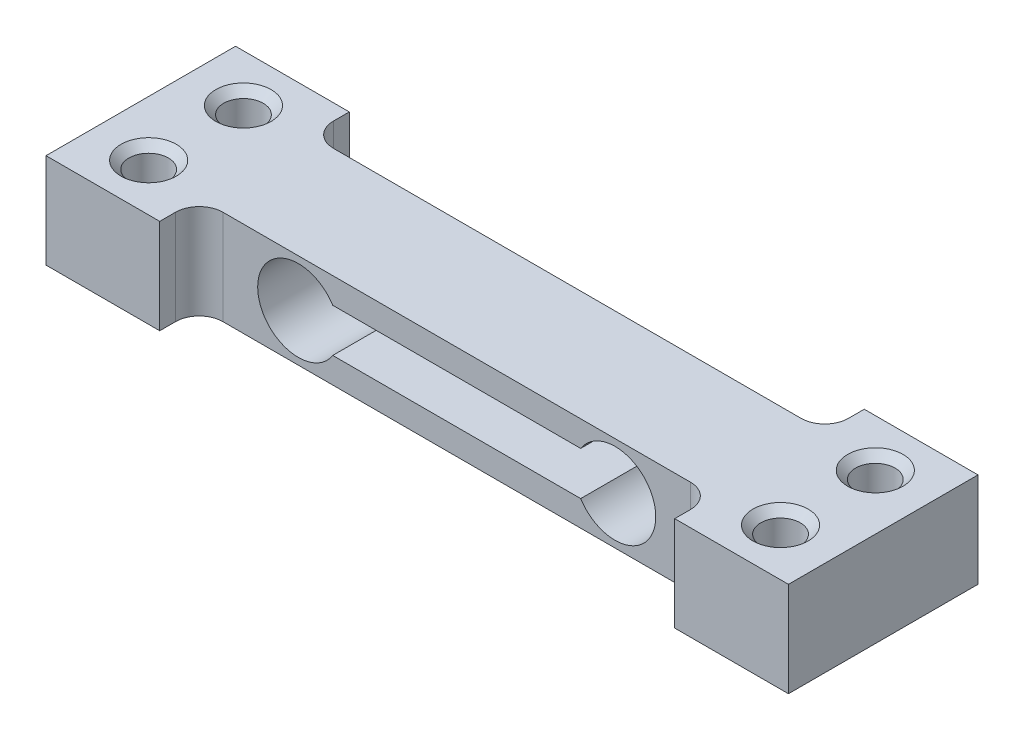
ISO-10303-21;
HEADER;
FILE_DESCRIPTION(('STEP AP214'),'2;1');
FILE_NAME('part.step','',(''),(''),'','','');
FILE_SCHEMA(('AUTOMOTIVE_DESIGN { 1 0 10303 214 1 1 1 1 }'));
ENDSEC;
DATA;
#1=APPLICATION_CONTEXT('core data for automotive mechanical design processes');
#2=APPLICATION_PROTOCOL_DEFINITION('international standard','automotive_design',2000,#1);
#3=PRODUCT_CONTEXT('',#1,'mechanical');
#4=PRODUCT('Part','Part','',(#3));
#5=PRODUCT_RELATED_PRODUCT_CATEGORY('part','',(#4));
#6=PRODUCT_DEFINITION_FORMATION('','',#4);
#7=PRODUCT_DEFINITION_CONTEXT('part definition',#1,'design');
#8=PRODUCT_DEFINITION('design','',#6,#7);
#9=PRODUCT_DEFINITION_SHAPE('','',#8);
#10=(LENGTH_UNIT() NAMED_UNIT(*) SI_UNIT(.MILLI.,.METRE.));
#11=(NAMED_UNIT(*) PLANE_ANGLE_UNIT() SI_UNIT($,.RADIAN.));
#12=(NAMED_UNIT(*) SI_UNIT($,.STERADIAN.) SOLID_ANGLE_UNIT());
#13=UNCERTAINTY_MEASURE_WITH_UNIT(LENGTH_MEASURE(1.E-05),#10,'distance_accuracy_value','');
#14=(GEOMETRIC_REPRESENTATION_CONTEXT(3) GLOBAL_UNCERTAINTY_ASSIGNED_CONTEXT((#13)) GLOBAL_UNIT_ASSIGNED_CONTEXT((#10,
#11,#12)) REPRESENTATION_CONTEXT('',''));
#15=CARTESIAN_POINT('',(0.,0.,0.));
#16=DIRECTION('',(0.,0.,1.));
#17=DIRECTION('',(1.,0.,0.));
#18=AXIS2_PLACEMENT_3D('',#15,#16,#17);
#19=CARTESIAN_POINT('',(0.,3.,-3.5));
#20=DIRECTION('',(0.,0.,1.));
#21=DIRECTION('',(1.,0.,0.));
#22=AXIS2_PLACEMENT_3D('',#19,#20,#21);
#23=PLANE('',#22);
#24=DIRECTION('',(1.,0.,0.));
#25=VECTOR('',#24,1.);
#26=CARTESIAN_POINT('',(0.,1.375,-3.5));
#27=LINE('',#26,#25);
#28=CARTESIAN_POINT('',(-7.84784589429227,1.375,-3.5));
#29=VERTEX_POINT('',#28);
#30=CARTESIAN_POINT('',(7.84784589429227,1.375,-3.5));
#31=VERTEX_POINT('',#30);
#32=EDGE_CURVE('E207',#29,#31,#27,.T.);
#33=ORIENTED_EDGE('',*,*,#32,.F.);
#34=CARTESIAN_POINT('',(-10.025,0.,-3.5));
#35=DIRECTION('',(0.,0.,-1.));
#36=DIRECTION('',(-1.,0.,0.));
#37=AXIS2_PLACEMENT_3D('',#34,#35,#36);
#38=CIRCLE('',#37,2.575);
#39=CARTESIAN_POINT('',(-7.84784589429227,-1.375,-3.5));
#40=VERTEX_POINT('',#39);
#41=EDGE_CURVE('E292',#40,#29,#38,.T.);
#42=ORIENTED_EDGE('',*,*,#41,.F.);
#43=DIRECTION('',(1.,0.,0.));
#44=VECTOR('',#43,1.);
#45=CARTESIAN_POINT('',(0.,-1.375,-3.5));
#46=LINE('',#45,#44);
#47=CARTESIAN_POINT('',(7.84784589429227,-1.375,-3.5));
#48=VERTEX_POINT('',#47);
#49=EDGE_CURVE('E204',#40,#48,#46,.T.);
#50=ORIENTED_EDGE('',*,*,#49,.T.);
#51=CARTESIAN_POINT('',(10.025,0.,-3.5));
#52=DIRECTION('',(0.,0.,1.));
#53=DIRECTION('',(1.,0.,0.));
#54=AXIS2_PLACEMENT_3D('',#51,#52,#53);
#55=CIRCLE('',#54,2.575);
#56=EDGE_CURVE('E147',#48,#31,#55,.T.);
#57=ORIENTED_EDGE('',*,*,#56,.T.);
#58=EDGE_LOOP('',(#33,#42,#50,#57));
#59=FACE_BOUND('',#58,.T.);
#60=DIRECTION('',(-1.,0.,0.));
#61=VECTOR('',#60,1.);
#62=CARTESIAN_POINT('',(0.,-3.,-3.5));
#63=LINE('',#62,#61);
#64=CARTESIAN_POINT('',(14.8,-3.,-3.5));
#65=VERTEX_POINT('',#64);
#66=CARTESIAN_POINT('',(-14.8,-3.,-3.5));
#67=VERTEX_POINT('',#66);
#68=EDGE_CURVE('E143',#65,#67,#63,.T.);
#69=ORIENTED_EDGE('',*,*,#68,.T.);
#70=DIRECTION('',(0.,-1.,0.));
#71=VECTOR('',#70,1.);
#72=CARTESIAN_POINT('',(-14.8,3.,-3.5));
#73=LINE('',#72,#71);
#74=CARTESIAN_POINT('',(-14.8,3.,-3.5));
#75=VERTEX_POINT('',#74);
#76=EDGE_CURVE('E266',#75,#67,#73,.T.);
#77=ORIENTED_EDGE('',*,*,#76,.F.);
#78=DIRECTION('',(-1.,0.,0.));
#79=VECTOR('',#78,1.);
#80=CARTESIAN_POINT('',(0.,3.,-3.5));
#81=LINE('',#80,#79);
#82=CARTESIAN_POINT('',(14.8,3.,-3.5));
#83=VERTEX_POINT('',#82);
#84=EDGE_CURVE('E161',#83,#75,#81,.T.);
#85=ORIENTED_EDGE('',*,*,#84,.F.);
#86=DIRECTION('',(0.,-1.,0.));
#87=VECTOR('',#86,1.);
#88=CARTESIAN_POINT('',(14.8,3.,-3.5));
#89=LINE('',#88,#87);
#90=EDGE_CURVE('E139',#83,#65,#89,.T.);
#91=ORIENTED_EDGE('',*,*,#90,.T.);
#92=EDGE_LOOP('',(#69,#77,#85,#91));
#93=FACE_BOUND('',#92,.T.);
#94=ADVANCED_FACE('F34',(#59,#93),#23,.F.);
#95=CARTESIAN_POINT('',(14.8,3.,3.5));
#96=DIRECTION('',(0.,0.,-1.));
#97=DIRECTION('',(-1.,0.,0.));
#98=AXIS2_PLACEMENT_3D('',#95,#96,#97);
#99=PLANE('',#98);
#100=CARTESIAN_POINT('',(-10.025,0.,3.5));
#101=DIRECTION('',(0.,0.,-1.));
#102=DIRECTION('',(-1.,0.,0.));
#103=AXIS2_PLACEMENT_3D('',#100,#101,#102);
#104=CIRCLE('',#103,2.575);
#105=CARTESIAN_POINT('',(-7.84784589429227,-1.375,3.5));
#106=VERTEX_POINT('',#105);
#107=CARTESIAN_POINT('',(-7.84784589429227,1.375,3.5));
#108=VERTEX_POINT('',#107);
#109=EDGE_CURVE('E318',#106,#108,#104,.T.);
#110=ORIENTED_EDGE('',*,*,#109,.T.);
#111=DIRECTION('',(1.,0.,0.));
#112=VECTOR('',#111,1.);
#113=CARTESIAN_POINT('',(0.,1.375,3.5));
#114=LINE('',#113,#112);
#115=CARTESIAN_POINT('',(7.84784589429227,1.375,3.5));
#116=VERTEX_POINT('',#115);
#117=EDGE_CURVE('E217',#108,#116,#114,.T.);
#118=ORIENTED_EDGE('',*,*,#117,.T.);
#119=CARTESIAN_POINT('',(10.025,0.,3.5));
#120=DIRECTION('',(0.,0.,1.));
#121=DIRECTION('',(1.,0.,0.));
#122=AXIS2_PLACEMENT_3D('',#119,#120,#121);
#123=CIRCLE('',#122,2.575);
#124=CARTESIAN_POINT('',(7.84784589429227,-1.375,3.5));
#125=VERTEX_POINT('',#124);
#126=EDGE_CURVE('E48',#125,#116,#123,.T.);
#127=ORIENTED_EDGE('',*,*,#126,.F.);
#128=DIRECTION('',(1.,0.,0.));
#129=VECTOR('',#128,1.);
#130=CARTESIAN_POINT('',(0.,-1.375,3.5));
#131=LINE('',#130,#129);
#132=EDGE_CURVE('E213',#106,#125,#131,.T.);
#133=ORIENTED_EDGE('',*,*,#132,.F.);
#134=EDGE_LOOP('',(#110,#118,#127,#133));
#135=FACE_BOUND('',#134,.T.);
#136=DIRECTION('',(1.,0.,0.));
#137=VECTOR('',#136,1.);
#138=CARTESIAN_POINT('',(14.8,3.,3.5));
#139=LINE('',#138,#137);
#140=CARTESIAN_POINT('',(-14.8,3.,3.5));
#141=VERTEX_POINT('',#140);
#142=CARTESIAN_POINT('',(14.8,3.,3.5));
#143=VERTEX_POINT('',#142);
#144=EDGE_CURVE('E98',#141,#143,#139,.T.);
#145=ORIENTED_EDGE('',*,*,#144,.F.);
#146=DIRECTION('',(0.,-1.,0.));
#147=VECTOR('',#146,1.);
#148=CARTESIAN_POINT('',(-14.8,3.,3.5));
#149=LINE('',#148,#147);
#150=CARTESIAN_POINT('',(-14.8,-3.,3.5));
#151=VERTEX_POINT('',#150);
#152=EDGE_CURVE('E245',#141,#151,#149,.T.);
#153=ORIENTED_EDGE('',*,*,#152,.T.);
#154=DIRECTION('',(1.,0.,0.));
#155=VECTOR('',#154,1.);
#156=CARTESIAN_POINT('',(14.8,-3.,3.5));
#157=LINE('',#156,#155);
#158=CARTESIAN_POINT('',(14.8,-3.,3.5));
#159=VERTEX_POINT('',#158);
#160=EDGE_CURVE('E146',#151,#159,#157,.T.);
#161=ORIENTED_EDGE('',*,*,#160,.T.);
#162=DIRECTION('',(0.,-1.,0.));
#163=VECTOR('',#162,1.);
#164=CARTESIAN_POINT('',(14.8,3.,3.5));
#165=LINE('',#164,#163);
#166=EDGE_CURVE('E11',#143,#159,#165,.T.);
#167=ORIENTED_EDGE('',*,*,#166,.F.);
#168=EDGE_LOOP('',(#145,#153,#161,#167));
#169=FACE_BOUND('',#168,.T.);
#170=ADVANCED_FACE('F388',(#135,#169),#99,.F.);
#171=CARTESIAN_POINT('',(14.8,3.,4.99999999999999));
#172=DIRECTION('',(0.,-1.,0.));
#173=DIRECTION('',(0.,0.,-1.));
#174=AXIS2_PLACEMENT_3D('',#171,#172,#173);
#175=CYLINDRICAL_SURFACE('',#174,1.5);
#176=CARTESIAN_POINT('',(14.8,-3.,4.99999999999999));
#177=DIRECTION('',(0.,-1.,0.));
#178=DIRECTION('',(0.,0.,1.));
#179=AXIS2_PLACEMENT_3D('',#176,#177,#178);
#180=CIRCLE('',#179,1.5);
#181=CARTESIAN_POINT('',(16.3,-3.,4.99999999999999));
#182=VERTEX_POINT('',#181);
#183=EDGE_CURVE('E149',#159,#182,#180,.T.);
#184=ORIENTED_EDGE('',*,*,#183,.T.);
#185=DIRECTION('',(0.,-1.,0.));
#186=VECTOR('',#185,1.);
#187=CARTESIAN_POINT('',(16.3,3.,4.99999999999999));
#188=LINE('',#187,#186);
#189=CARTESIAN_POINT('',(16.3,3.,4.99999999999999));
#190=VERTEX_POINT('',#189);
#191=EDGE_CURVE('E41',#190,#182,#188,.T.);
#192=ORIENTED_EDGE('',*,*,#191,.F.);
#193=CARTESIAN_POINT('',(14.8,3.,4.99999999999999));
#194=DIRECTION('',(0.,-1.,0.));
#195=DIRECTION('',(0.,0.,1.));
#196=AXIS2_PLACEMENT_3D('',#193,#194,#195);
#197=CIRCLE('',#196,1.5);
#198=EDGE_CURVE('E198',#143,#190,#197,.T.);
#199=ORIENTED_EDGE('',*,*,#198,.F.);
#200=ORIENTED_EDGE('',*,*,#166,.T.);
#201=EDGE_LOOP('',(#184,#192,#199,#200));
#202=FACE_BOUND('',#201,.T.);
#203=ADVANCED_FACE('F393',(#202),#175,.F.);
#204=CARTESIAN_POINT('',(16.3,3.,4.99999999999999));
#205=DIRECTION('',(1.,0.,0.));
#206=DIRECTION('',(0.,0.,-1.));
#207=AXIS2_PLACEMENT_3D('',#204,#205,#206);
#208=PLANE('',#207);
#209=DIRECTION('',(0.,0.,1.));
#210=VECTOR('',#209,1.);
#211=CARTESIAN_POINT('',(16.3,-3.,4.99999999999999));
#212=LINE('',#211,#210);
#213=CARTESIAN_POINT('',(16.3,-3.,6.));
#214=VERTEX_POINT('',#213);
#215=EDGE_CURVE('E151',#182,#214,#212,.T.);
#216=ORIENTED_EDGE('',*,*,#215,.T.);
#217=DIRECTION('',(0.,-1.,0.));
#218=VECTOR('',#217,1.);
#219=CARTESIAN_POINT('',(16.3,3.,6.));
#220=LINE('',#219,#218);
#221=CARTESIAN_POINT('',(16.3,3.,6.));
#222=VERTEX_POINT('',#221);
#223=EDGE_CURVE('E168',#222,#214,#220,.T.);
#224=ORIENTED_EDGE('',*,*,#223,.F.);
#225=DIRECTION('',(0.,0.,1.));
#226=VECTOR('',#225,1.);
#227=CARTESIAN_POINT('',(16.3,3.,4.99999999999999));
#228=LINE('',#227,#226);
#229=EDGE_CURVE('E177',#190,#222,#228,.T.);
#230=ORIENTED_EDGE('',*,*,#229,.F.);
#231=ORIENTED_EDGE('',*,*,#191,.T.);
#232=EDGE_LOOP('',(#216,#224,#230,#231));
#233=FACE_BOUND('',#232,.T.);
#234=ADVANCED_FACE('F175',(#233),#208,.F.);
#235=CARTESIAN_POINT('',(23.5,3.,6.));
#236=DIRECTION('',(0.,0.,-1.));
#237=DIRECTION('',(-1.,0.,0.));
#238=AXIS2_PLACEMENT_3D('',#235,#236,#237);
#239=PLANE('',#238);
#240=DIRECTION('',(1.,0.,0.));
#241=VECTOR('',#240,1.);
#242=CARTESIAN_POINT('',(23.5,-3.,6.));
#243=LINE('',#242,#241);
#244=CARTESIAN_POINT('',(23.5,-3.,6.));
#245=VERTEX_POINT('',#244);
#246=EDGE_CURVE('E153',#214,#245,#243,.T.);
#247=ORIENTED_EDGE('',*,*,#246,.T.);
#248=DIRECTION('',(0.,-1.,0.));
#249=VECTOR('',#248,1.);
#250=CARTESIAN_POINT('',(23.5,3.,6.));
#251=LINE('',#250,#249);
#252=CARTESIAN_POINT('',(23.5,3.,6.));
#253=VERTEX_POINT('',#252);
#254=EDGE_CURVE('E165',#253,#245,#251,.T.);
#255=ORIENTED_EDGE('',*,*,#254,.F.);
#256=DIRECTION('',(1.,0.,0.));
#257=VECTOR('',#256,1.);
#258=CARTESIAN_POINT('',(23.5,3.,6.));
#259=LINE('',#258,#257);
#260=EDGE_CURVE('E194',#222,#253,#259,.T.);
#261=ORIENTED_EDGE('',*,*,#260,.F.);
#262=ORIENTED_EDGE('',*,*,#223,.T.);
#263=EDGE_LOOP('',(#247,#255,#261,#262));
#264=FACE_BOUND('',#263,.T.);
#265=ADVANCED_FACE('F190',(#264),#239,.F.);
#266=CARTESIAN_POINT('',(23.5,3.,-6.));
#267=DIRECTION('',(-1.,0.,0.));
#268=DIRECTION('',(0.,0.,1.));
#269=AXIS2_PLACEMENT_3D('',#266,#267,#268);
#270=PLANE('',#269);
#271=DIRECTION('',(0.,0.,-1.));
#272=VECTOR('',#271,1.);
#273=CARTESIAN_POINT('',(23.5,-3.,-6.));
#274=LINE('',#273,#272);
#275=CARTESIAN_POINT('',(23.5,-3.,-6.));
#276=VERTEX_POINT('',#275);
#277=EDGE_CURVE('E155',#245,#276,#274,.T.);
#278=ORIENTED_EDGE('',*,*,#277,.T.);
#279=DIRECTION('',(0.,-1.,0.));
#280=VECTOR('',#279,1.);
#281=CARTESIAN_POINT('',(23.5,3.,-6.));
#282=LINE('',#281,#280);
#283=CARTESIAN_POINT('',(23.5,3.,-6.));
#284=VERTEX_POINT('',#283);
#285=EDGE_CURVE('E134',#284,#276,#282,.T.);
#286=ORIENTED_EDGE('',*,*,#285,.F.);
#287=DIRECTION('',(0.,0.,-1.));
#288=VECTOR('',#287,1.);
#289=CARTESIAN_POINT('',(23.5,3.,-6.));
#290=LINE('',#289,#288);
#291=EDGE_CURVE('E122',#253,#284,#290,.T.);
#292=ORIENTED_EDGE('',*,*,#291,.F.);
#293=ORIENTED_EDGE('',*,*,#254,.T.);
#294=EDGE_LOOP('',(#278,#286,#292,#293));
#295=FACE_BOUND('',#294,.T.);
#296=ADVANCED_FACE('F193',(#295),#270,.F.);
#297=CARTESIAN_POINT('',(16.3,3.,-6.));
#298=DIRECTION('',(0.,0.,1.));
#299=DIRECTION('',(1.,0.,0.));
#300=AXIS2_PLACEMENT_3D('',#297,#298,#299);
#301=PLANE('',#300);
#302=DIRECTION('',(-1.,0.,0.));
#303=VECTOR('',#302,1.);
#304=CARTESIAN_POINT('',(16.3,-3.,-6.));
#305=LINE('',#304,#303);
#306=CARTESIAN_POINT('',(16.3,-3.,-6.));
#307=VERTEX_POINT('',#306);
#308=EDGE_CURVE('E131',#276,#307,#305,.T.);
#309=ORIENTED_EDGE('',*,*,#308,.T.);
#310=DIRECTION('',(0.,-1.,0.));
#311=VECTOR('',#310,1.);
#312=CARTESIAN_POINT('',(16.3,3.,-6.));
#313=LINE('',#312,#311);
#314=CARTESIAN_POINT('',(16.3,3.,-6.));
#315=VERTEX_POINT('',#314);
#316=EDGE_CURVE('E128',#315,#307,#313,.T.);
#317=ORIENTED_EDGE('',*,*,#316,.F.);
#318=DIRECTION('',(-1.,0.,0.));
#319=VECTOR('',#318,1.);
#320=CARTESIAN_POINT('',(16.3,3.,-6.));
#321=LINE('',#320,#319);
#322=EDGE_CURVE('E114',#284,#315,#321,.T.);
#323=ORIENTED_EDGE('',*,*,#322,.F.);
#324=ORIENTED_EDGE('',*,*,#285,.T.);
#325=EDGE_LOOP('',(#309,#317,#323,#324));
#326=FACE_BOUND('',#325,.T.);
#327=ADVANCED_FACE('F129',(#326),#301,.F.);
#328=CARTESIAN_POINT('',(16.3,3.,-5.));
#329=DIRECTION('',(1.,0.,0.));
#330=DIRECTION('',(0.,0.,-1.));
#331=AXIS2_PLACEMENT_3D('',#328,#329,#330);
#332=PLANE('',#331);
#333=DIRECTION('',(0.,0.,1.));
#334=VECTOR('',#333,1.);
#335=CARTESIAN_POINT('',(16.3,-3.,-5.));
#336=LINE('',#335,#334);
#337=CARTESIAN_POINT('',(16.3,-3.,-5.));
#338=VERTEX_POINT('',#337);
#339=EDGE_CURVE('E158',#307,#338,#336,.T.);
#340=ORIENTED_EDGE('',*,*,#339,.T.);
#341=DIRECTION('',(0.,-1.,0.));
#342=VECTOR('',#341,1.);
#343=CARTESIAN_POINT('',(16.3,3.,-5.));
#344=LINE('',#343,#342);
#345=CARTESIAN_POINT('',(16.3,3.,-5.));
#346=VERTEX_POINT('',#345);
#347=EDGE_CURVE('E135',#346,#338,#344,.T.);
#348=ORIENTED_EDGE('',*,*,#347,.F.);
#349=DIRECTION('',(0.,0.,1.));
#350=VECTOR('',#349,1.);
#351=CARTESIAN_POINT('',(16.3,3.,-5.));
#352=LINE('',#351,#350);
#353=EDGE_CURVE('E119',#315,#346,#352,.T.);
#354=ORIENTED_EDGE('',*,*,#353,.F.);
#355=ORIENTED_EDGE('',*,*,#316,.T.);
#356=EDGE_LOOP('',(#340,#348,#354,#355));
#357=FACE_BOUND('',#356,.T.);
#358=ADVANCED_FACE('F137',(#357),#332,.F.);
#359=CARTESIAN_POINT('',(14.8,3.,-5.));
#360=DIRECTION('',(0.,-1.,0.));
#361=DIRECTION('',(0.,0.,-1.));
#362=AXIS2_PLACEMENT_3D('',#359,#360,#361);
#363=CYLINDRICAL_SURFACE('',#362,1.5);
#364=CARTESIAN_POINT('',(14.8,-3.,-5.));
#365=DIRECTION('',(0.,-1.,0.));
#366=DIRECTION('',(0.,0.,1.));
#367=AXIS2_PLACEMENT_3D('',#364,#365,#366);
#368=CIRCLE('',#367,1.5);
#369=EDGE_CURVE('E90',#338,#65,#368,.T.);
#370=ORIENTED_EDGE('',*,*,#369,.T.);
#371=ORIENTED_EDGE('',*,*,#90,.F.);
#372=CARTESIAN_POINT('',(14.8,3.,-5.));
#373=DIRECTION('',(0.,-1.,0.));
#374=DIRECTION('',(0.,0.,1.));
#375=AXIS2_PLACEMENT_3D('',#372,#373,#374);
#376=CIRCLE('',#375,1.5);
#377=EDGE_CURVE('E57',#346,#83,#376,.T.);
#378=ORIENTED_EDGE('',*,*,#377,.F.);
#379=ORIENTED_EDGE('',*,*,#347,.T.);
#380=EDGE_LOOP('',(#370,#371,#378,#379));
#381=FACE_BOUND('',#380,.T.);
#382=ADVANCED_FACE('F377',(#381),#363,.F.);
#383=CARTESIAN_POINT('',(14.8,3.,-5.));
#384=DIRECTION('',(0.,1.,0.));
#385=DIRECTION('',(0.,0.,1.));
#386=AXIS2_PLACEMENT_3D('',#383,#384,#385);
#387=PLANE('',#386);
#388=CARTESIAN_POINT('',(20.,3.,-3.));
#389=DIRECTION('',(0.,1.,0.));
#390=DIRECTION('',(0.,0.,1.));
#391=AXIS2_PLACEMENT_3D('',#388,#389,#390);
#392=CIRCLE('',#391,1.75);
#393=CARTESIAN_POINT('',(20.,3.,-1.25));
#394=VERTEX_POINT('',#393);
#395=EDGE_CURVE('E239',#394,#394,#392,.T.);
#396=ORIENTED_EDGE('',*,*,#395,.F.);
#397=EDGE_LOOP('',(#396));
#398=FACE_BOUND('',#397,.T.);
#399=CARTESIAN_POINT('',(20.,3.,3.));
#400=DIRECTION('',(0.,1.,0.));
#401=DIRECTION('',(0.,0.,1.));
#402=AXIS2_PLACEMENT_3D('',#399,#400,#401);
#403=CIRCLE('',#402,1.75);
#404=CARTESIAN_POINT('',(20.,3.,4.75));
#405=VERTEX_POINT('',#404);
#406=EDGE_CURVE('E227',#405,#405,#403,.T.);
#407=ORIENTED_EDGE('',*,*,#406,.F.);
#408=EDGE_LOOP('',(#407));
#409=FACE_BOUND('',#408,.T.);
#410=ORIENTED_EDGE('',*,*,#84,.T.);
#411=CARTESIAN_POINT('',(-14.8,3.,-5.));
#412=DIRECTION('',(0.,1.,0.));
#413=DIRECTION('',(0.,0.,1.));
#414=AXIS2_PLACEMENT_3D('',#411,#412,#413);
#415=CIRCLE('',#414,1.5);
#416=CARTESIAN_POINT('',(-16.3,3.,-5.));
#417=VERTEX_POINT('',#416);
#418=EDGE_CURVE('E269',#417,#75,#415,.T.);
#419=ORIENTED_EDGE('',*,*,#418,.F.);
#420=DIRECTION('',(0.,0.,1.));
#421=VECTOR('',#420,1.);
#422=CARTESIAN_POINT('',(-16.3,3.,-5.));
#423=LINE('',#422,#421);
#424=CARTESIAN_POINT('',(-16.3,3.,-6.));
#425=VERTEX_POINT('',#424);
#426=EDGE_CURVE('E295',#425,#417,#423,.T.);
#427=ORIENTED_EDGE('',*,*,#426,.F.);
#428=DIRECTION('',(1.,0.,0.));
#429=VECTOR('',#428,1.);
#430=CARTESIAN_POINT('',(-16.3,3.,-6.));
#431=LINE('',#430,#429);
#432=CARTESIAN_POINT('',(-23.5,3.,-6.));
#433=VERTEX_POINT('',#432);
#434=EDGE_CURVE('E298',#433,#425,#431,.T.);
#435=ORIENTED_EDGE('',*,*,#434,.F.);
#436=DIRECTION('',(0.,0.,-1.));
#437=VECTOR('',#436,1.);
#438=CARTESIAN_POINT('',(-23.5,3.,-6.));
#439=LINE('',#438,#437);
#440=CARTESIAN_POINT('',(-23.5,3.,6.));
#441=VERTEX_POINT('',#440);
#442=EDGE_CURVE('E301',#441,#433,#439,.T.);
#443=ORIENTED_EDGE('',*,*,#442,.F.);
#444=DIRECTION('',(-1.,0.,0.));
#445=VECTOR('',#444,1.);
#446=CARTESIAN_POINT('',(-23.5,3.,6.));
#447=LINE('',#446,#445);
#448=CARTESIAN_POINT('',(-16.3,3.,6.));
#449=VERTEX_POINT('',#448);
#450=EDGE_CURVE('E304',#449,#441,#447,.T.);
#451=ORIENTED_EDGE('',*,*,#450,.F.);
#452=DIRECTION('',(0.,0.,1.));
#453=VECTOR('',#452,1.);
#454=CARTESIAN_POINT('',(-16.3,3.,4.99999999999999));
#455=LINE('',#454,#453);
#456=CARTESIAN_POINT('',(-16.3,3.,4.99999999999999));
#457=VERTEX_POINT('',#456);
#458=EDGE_CURVE('E307',#457,#449,#455,.T.);
#459=ORIENTED_EDGE('',*,*,#458,.F.);
#460=CARTESIAN_POINT('',(-14.8,3.,4.99999999999999));
#461=DIRECTION('',(0.,1.,0.));
#462=DIRECTION('',(0.,0.,1.));
#463=AXIS2_PLACEMENT_3D('',#460,#461,#462);
#464=CIRCLE('',#463,1.5);
#465=EDGE_CURVE('E273',#141,#457,#464,.T.);
#466=ORIENTED_EDGE('',*,*,#465,.F.);
#467=ORIENTED_EDGE('',*,*,#144,.T.);
#468=ORIENTED_EDGE('',*,*,#198,.T.);
#469=ORIENTED_EDGE('',*,*,#229,.T.);
#470=ORIENTED_EDGE('',*,*,#260,.T.);
#471=ORIENTED_EDGE('',*,*,#291,.T.);
#472=ORIENTED_EDGE('',*,*,#322,.T.);
#473=ORIENTED_EDGE('',*,*,#353,.T.);
#474=ORIENTED_EDGE('',*,*,#377,.T.);
#475=EDGE_LOOP('',(#410,#419,#427,#435,#443,#451,#459,#466,#467,#468,#469,#470,#471,#472,#473,#474));
#476=FACE_BOUND('',#475,.T.);
#477=CARTESIAN_POINT('',(-20.,3.,-3.));
#478=DIRECTION('',(0.,-1.,0.));
#479=DIRECTION('',(0.,0.,1.));
#480=AXIS2_PLACEMENT_3D('',#477,#478,#479);
#481=CIRCLE('',#480,1.75);
#482=CARTESIAN_POINT('',(-20.,3.,-1.25));
#483=VERTEX_POINT('',#482);
#484=EDGE_CURVE('E341',#483,#483,#481,.T.);
#485=ORIENTED_EDGE('',*,*,#484,.T.);
#486=EDGE_LOOP('',(#485));
#487=FACE_BOUND('',#486,.T.);
#488=CARTESIAN_POINT('',(-20.,3.,3.));
#489=DIRECTION('',(0.,-1.,0.));
#490=DIRECTION('',(0.,0.,1.));
#491=AXIS2_PLACEMENT_3D('',#488,#489,#490);
#492=CIRCLE('',#491,1.75);
#493=CARTESIAN_POINT('',(-20.,3.,4.75));
#494=VERTEX_POINT('',#493);
#495=EDGE_CURVE('E329',#494,#494,#492,.T.);
#496=ORIENTED_EDGE('',*,*,#495,.T.);
#497=EDGE_LOOP('',(#496));
#498=FACE_BOUND('',#497,.T.);
#499=ADVANCED_FACE('F116',(#398,#409,#476,#487,#498),#387,.T.);
#500=CARTESIAN_POINT('',(14.8,-3.,-5.));
#501=DIRECTION('',(0.,1.,0.));
#502=DIRECTION('',(0.,0.,1.));
#503=AXIS2_PLACEMENT_3D('',#500,#501,#502);
#504=PLANE('',#503);
#505=CARTESIAN_POINT('',(20.,-3.,-3.));
#506=DIRECTION('',(0.,1.,0.));
#507=DIRECTION('',(0.,0.,1.));
#508=AXIS2_PLACEMENT_3D('',#505,#506,#507);
#509=CIRCLE('',#508,1.75);
#510=CARTESIAN_POINT('',(20.,-3.,-1.25));
#511=VERTEX_POINT('',#510);
#512=EDGE_CURVE('E242',#511,#511,#509,.T.);
#513=ORIENTED_EDGE('',*,*,#512,.T.);
#514=EDGE_LOOP('',(#513));
#515=FACE_BOUND('',#514,.T.);
#516=CARTESIAN_POINT('',(20.,-3.,3.));
#517=DIRECTION('',(0.,1.,0.));
#518=DIRECTION('',(0.,0.,1.));
#519=AXIS2_PLACEMENT_3D('',#516,#517,#518);
#520=CIRCLE('',#519,1.75);
#521=CARTESIAN_POINT('',(20.,-3.,4.75));
#522=VERTEX_POINT('',#521);
#523=EDGE_CURVE('E230',#522,#522,#520,.T.);
#524=ORIENTED_EDGE('',*,*,#523,.T.);
#525=EDGE_LOOP('',(#524));
#526=FACE_BOUND('',#525,.T.);
#527=ORIENTED_EDGE('',*,*,#68,.F.);
#528=ORIENTED_EDGE('',*,*,#369,.F.);
#529=ORIENTED_EDGE('',*,*,#339,.F.);
#530=ORIENTED_EDGE('',*,*,#308,.F.);
#531=ORIENTED_EDGE('',*,*,#277,.F.);
#532=ORIENTED_EDGE('',*,*,#246,.F.);
#533=ORIENTED_EDGE('',*,*,#215,.F.);
#534=ORIENTED_EDGE('',*,*,#183,.F.);
#535=ORIENTED_EDGE('',*,*,#160,.F.);
#536=CARTESIAN_POINT('',(-14.8,-3.,4.99999999999999));
#537=DIRECTION('',(0.,1.,0.));
#538=DIRECTION('',(0.,0.,1.));
#539=AXIS2_PLACEMENT_3D('',#536,#537,#538);
#540=CIRCLE('',#539,1.5);
#541=CARTESIAN_POINT('',(-16.3,-3.,4.99999999999999));
#542=VERTEX_POINT('',#541);
#543=EDGE_CURVE('E289',#151,#542,#540,.T.);
#544=ORIENTED_EDGE('',*,*,#543,.T.);
#545=DIRECTION('',(0.,0.,1.));
#546=VECTOR('',#545,1.);
#547=CARTESIAN_POINT('',(-16.3,-3.,4.99999999999999));
#548=LINE('',#547,#546);
#549=CARTESIAN_POINT('',(-16.3,-3.,6.));
#550=VERTEX_POINT('',#549);
#551=EDGE_CURVE('E286',#542,#550,#548,.T.);
#552=ORIENTED_EDGE('',*,*,#551,.T.);
#553=DIRECTION('',(-1.,0.,0.));
#554=VECTOR('',#553,1.);
#555=CARTESIAN_POINT('',(-23.5,-3.,6.));
#556=LINE('',#555,#554);
#557=CARTESIAN_POINT('',(-23.5,-3.,6.));
#558=VERTEX_POINT('',#557);
#559=EDGE_CURVE('E283',#550,#558,#556,.T.);
#560=ORIENTED_EDGE('',*,*,#559,.T.);
#561=DIRECTION('',(0.,0.,-1.));
#562=VECTOR('',#561,1.);
#563=CARTESIAN_POINT('',(-23.5,-3.,-6.));
#564=LINE('',#563,#562);
#565=CARTESIAN_POINT('',(-23.5,-3.,-6.));
#566=VERTEX_POINT('',#565);
#567=EDGE_CURVE('E280',#558,#566,#564,.T.);
#568=ORIENTED_EDGE('',*,*,#567,.T.);
#569=DIRECTION('',(1.,0.,0.));
#570=VECTOR('',#569,1.);
#571=CARTESIAN_POINT('',(-16.3,-3.,-6.));
#572=LINE('',#571,#570);
#573=CARTESIAN_POINT('',(-16.3,-3.,-6.));
#574=VERTEX_POINT('',#573);
#575=EDGE_CURVE('E277',#566,#574,#572,.T.);
#576=ORIENTED_EDGE('',*,*,#575,.T.);
#577=DIRECTION('',(0.,0.,1.));
#578=VECTOR('',#577,1.);
#579=CARTESIAN_POINT('',(-16.3,-3.,-5.));
#580=LINE('',#579,#578);
#581=CARTESIAN_POINT('',(-16.3,-3.,-5.));
#582=VERTEX_POINT('',#581);
#583=EDGE_CURVE('E274',#574,#582,#580,.T.);
#584=ORIENTED_EDGE('',*,*,#583,.T.);
#585=CARTESIAN_POINT('',(-14.8,-3.,-5.));
#586=DIRECTION('',(0.,1.,0.));
#587=DIRECTION('',(0.,0.,1.));
#588=AXIS2_PLACEMENT_3D('',#585,#586,#587);
#589=CIRCLE('',#588,1.5);
#590=EDGE_CURVE('E270',#582,#67,#589,.T.);
#591=ORIENTED_EDGE('',*,*,#590,.T.);
#592=EDGE_LOOP('',(#527,#528,#529,#530,#531,#532,#533,#534,#535,#544,#552,#560,#568,#576,#584,#591));
#593=FACE_BOUND('',#592,.T.);
#594=CARTESIAN_POINT('',(-20.,-3.,-3.));
#595=DIRECTION('',(0.,-1.,0.));
#596=DIRECTION('',(0.,0.,1.));
#597=AXIS2_PLACEMENT_3D('',#594,#595,#596);
#598=CIRCLE('',#597,1.75);
#599=CARTESIAN_POINT('',(-20.,-3.,-1.25));
#600=VERTEX_POINT('',#599);
#601=EDGE_CURVE('E344',#600,#600,#598,.T.);
#602=ORIENTED_EDGE('',*,*,#601,.F.);
#603=EDGE_LOOP('',(#602));
#604=FACE_BOUND('',#603,.T.);
#605=CARTESIAN_POINT('',(-20.,-3.,3.));
#606=DIRECTION('',(0.,-1.,0.));
#607=DIRECTION('',(0.,0.,1.));
#608=AXIS2_PLACEMENT_3D('',#605,#606,#607);
#609=CIRCLE('',#608,1.75);
#610=CARTESIAN_POINT('',(-20.,-3.,4.75));
#611=VERTEX_POINT('',#610);
#612=EDGE_CURVE('E332',#611,#611,#609,.T.);
#613=ORIENTED_EDGE('',*,*,#612,.F.);
#614=EDGE_LOOP('',(#613));
#615=FACE_BOUND('',#614,.T.);
#616=ADVANCED_FACE('F184',(#515,#526,#593,#604,#615),#504,.F.);
#617=CARTESIAN_POINT('',(10.025,0.,-6.));
#618=DIRECTION('',(0.,0.,1.));
#619=DIRECTION('',(1.,0.,0.));
#620=AXIS2_PLACEMENT_3D('',#617,#618,#619);
#621=CYLINDRICAL_SURFACE('',#620,2.575);
#622=DIRECTION('',(0.,0.,1.));
#623=VECTOR('',#622,1.);
#624=CARTESIAN_POINT('',(7.84784589429227,-1.375,-6.));
#625=LINE('',#624,#623);
#626=EDGE_CURVE('E210',#48,#125,#625,.T.);
#627=ORIENTED_EDGE('',*,*,#626,.T.);
#628=ORIENTED_EDGE('',*,*,#126,.T.);
#629=DIRECTION('',(0.,0.,1.));
#630=VECTOR('',#629,1.);
#631=CARTESIAN_POINT('',(7.84784589429227,1.375,-6.));
#632=LINE('',#631,#630);
#633=EDGE_CURVE('E211',#31,#116,#632,.T.);
#634=ORIENTED_EDGE('',*,*,#633,.F.);
#635=ORIENTED_EDGE('',*,*,#56,.F.);
#636=EDGE_LOOP('',(#627,#628,#634,#635));
#637=FACE_BOUND('',#636,.T.);
#638=ADVANCED_FACE('F352',(#637),#621,.F.);
#639=CARTESIAN_POINT('',(0.,-1.375,-6.));
#640=DIRECTION('',(0.,-1.,0.));
#641=DIRECTION('',(0.,0.,-1.));
#642=AXIS2_PLACEMENT_3D('',#639,#640,#641);
#643=PLANE('',#642);
#644=ORIENTED_EDGE('',*,*,#49,.F.);
#645=DIRECTION('',(0.,0.,1.));
#646=VECTOR('',#645,1.);
#647=CARTESIAN_POINT('',(-7.84784589429227,-1.375,-6.));
#648=LINE('',#647,#646);
#649=EDGE_CURVE('E314',#40,#106,#648,.T.);
#650=ORIENTED_EDGE('',*,*,#649,.T.);
#651=ORIENTED_EDGE('',*,*,#132,.T.);
#652=ORIENTED_EDGE('',*,*,#626,.F.);
#653=EDGE_LOOP('',(#644,#650,#651,#652));
#654=FACE_BOUND('',#653,.T.);
#655=ADVANCED_FACE('F452',(#654),#643,.F.);
#656=CARTESIAN_POINT('',(0.,1.375,-6.));
#657=DIRECTION('',(0.,-1.,0.));
#658=DIRECTION('',(0.,0.,-1.));
#659=AXIS2_PLACEMENT_3D('',#656,#657,#658);
#660=PLANE('',#659);
#661=ORIENTED_EDGE('',*,*,#32,.T.);
#662=ORIENTED_EDGE('',*,*,#633,.T.);
#663=ORIENTED_EDGE('',*,*,#117,.F.);
#664=DIRECTION('',(0.,0.,1.));
#665=VECTOR('',#664,1.);
#666=CARTESIAN_POINT('',(-7.84784589429227,1.375,-6.));
#667=LINE('',#666,#665);
#668=EDGE_CURVE('E315',#29,#108,#667,.T.);
#669=ORIENTED_EDGE('',*,*,#668,.F.);
#670=EDGE_LOOP('',(#661,#662,#663,#669));
#671=FACE_BOUND('',#670,.T.);
#672=ADVANCED_FACE('F534',(#671),#660,.T.);
#673=CARTESIAN_POINT('',(20.,-2.5,3.));
#674=DIRECTION('',(0.,-1.,0.));
#675=DIRECTION('',(0.,0.,-1.));
#676=AXIS2_PLACEMENT_3D('',#673,#674,#675);
#677=CONICAL_SURFACE('',#676,1.25,0.785398163397448);
#678=ORIENTED_EDGE('',*,*,#523,.F.);
#679=EDGE_LOOP('',(#678));
#680=FACE_BOUND('',#679,.T.);
#681=CARTESIAN_POINT('',(20.,-2.5,3.));
#682=DIRECTION('',(0.,1.,0.));
#683=DIRECTION('',(0.,0.,1.));
#684=AXIS2_PLACEMENT_3D('',#681,#682,#683);
#685=CIRCLE('',#684,1.25);
#686=CARTESIAN_POINT('',(20.,-2.5,4.25));
#687=VERTEX_POINT('',#686);
#688=EDGE_CURVE('E221',#687,#687,#685,.T.);
#689=ORIENTED_EDGE('',*,*,#688,.T.);
#690=EDGE_LOOP('',(#689));
#691=FACE_BOUND('',#690,.T.);
#692=ADVANCED_FACE('F540',(#680,#691),#677,.F.);
#693=CARTESIAN_POINT('',(20.,3.,3.));
#694=DIRECTION('',(0.,1.,0.));
#695=DIRECTION('',(0.,0.,1.));
#696=AXIS2_PLACEMENT_3D('',#693,#694,#695);
#697=CYLINDRICAL_SURFACE('',#696,1.25);
#698=ORIENTED_EDGE('',*,*,#688,.F.);
#699=EDGE_LOOP('',(#698));
#700=FACE_BOUND('',#699,.T.);
#701=CARTESIAN_POINT('',(20.,2.5,3.));
#702=DIRECTION('',(0.,1.,0.));
#703=DIRECTION('',(0.,0.,1.));
#704=AXIS2_PLACEMENT_3D('',#701,#702,#703);
#705=CIRCLE('',#704,1.25);
#706=CARTESIAN_POINT('',(20.,2.5,4.25));
#707=VERTEX_POINT('',#706);
#708=EDGE_CURVE('E224',#707,#707,#705,.T.);
#709=ORIENTED_EDGE('',*,*,#708,.T.);
#710=EDGE_LOOP('',(#709));
#711=FACE_BOUND('',#710,.T.);
#712=ADVANCED_FACE('F557',(#700,#711),#697,.F.);
#713=CARTESIAN_POINT('',(20.,3.,3.));
#714=DIRECTION('',(0.,1.,0.));
#715=DIRECTION('',(0.,0.,1.));
#716=AXIS2_PLACEMENT_3D('',#713,#714,#715);
#717=CONICAL_SURFACE('',#716,1.75,0.785398163397447);
#718=ORIENTED_EDGE('',*,*,#708,.F.);
#719=EDGE_LOOP('',(#718));
#720=FACE_BOUND('',#719,.T.);
#721=ORIENTED_EDGE('',*,*,#406,.T.);
#722=EDGE_LOOP('',(#721));
#723=FACE_BOUND('',#722,.T.);
#724=ADVANCED_FACE('F720',(#720,#723),#717,.F.);
#725=CARTESIAN_POINT('',(20.,-2.5,-3.));
#726=DIRECTION('',(0.,-1.,0.));
#727=DIRECTION('',(0.,0.,-1.));
#728=AXIS2_PLACEMENT_3D('',#725,#726,#727);
#729=CONICAL_SURFACE('',#728,1.25,0.785398163397448);
#730=ORIENTED_EDGE('',*,*,#512,.F.);
#731=EDGE_LOOP('',(#730));
#732=FACE_BOUND('',#731,.T.);
#733=CARTESIAN_POINT('',(20.,-2.5,-3.));
#734=DIRECTION('',(0.,1.,0.));
#735=DIRECTION('',(0.,0.,1.));
#736=AXIS2_PLACEMENT_3D('',#733,#734,#735);
#737=CIRCLE('',#736,1.25);
#738=CARTESIAN_POINT('',(20.,-2.5,-1.75));
#739=VERTEX_POINT('',#738);
#740=EDGE_CURVE('E233',#739,#739,#737,.T.);
#741=ORIENTED_EDGE('',*,*,#740,.T.);
#742=EDGE_LOOP('',(#741));
#743=FACE_BOUND('',#742,.T.);
#744=ADVANCED_FACE('F716',(#732,#743),#729,.F.);
#745=CARTESIAN_POINT('',(20.,3.,-3.));
#746=DIRECTION('',(0.,1.,0.));
#747=DIRECTION('',(0.,0.,1.));
#748=AXIS2_PLACEMENT_3D('',#745,#746,#747);
#749=CYLINDRICAL_SURFACE('',#748,1.25);
#750=ORIENTED_EDGE('',*,*,#740,.F.);
#751=EDGE_LOOP('',(#750));
#752=FACE_BOUND('',#751,.T.);
#753=CARTESIAN_POINT('',(20.,2.5,-3.));
#754=DIRECTION('',(0.,1.,0.));
#755=DIRECTION('',(0.,0.,1.));
#756=AXIS2_PLACEMENT_3D('',#753,#754,#755);
#757=CIRCLE('',#756,1.25);
#758=CARTESIAN_POINT('',(20.,2.5,-1.75));
#759=VERTEX_POINT('',#758);
#760=EDGE_CURVE('E236',#759,#759,#757,.T.);
#761=ORIENTED_EDGE('',*,*,#760,.T.);
#762=EDGE_LOOP('',(#761));
#763=FACE_BOUND('',#762,.T.);
#764=ADVANCED_FACE('F712',(#752,#763),#749,.F.);
#765=CARTESIAN_POINT('',(20.,3.,-3.));
#766=DIRECTION('',(0.,1.,0.));
#767=DIRECTION('',(0.,0.,1.));
#768=AXIS2_PLACEMENT_3D('',#765,#766,#767);
#769=CONICAL_SURFACE('',#768,1.75,0.785398163397443);
#770=ORIENTED_EDGE('',*,*,#760,.F.);
#771=EDGE_LOOP('',(#770));
#772=FACE_BOUND('',#771,.T.);
#773=ORIENTED_EDGE('',*,*,#395,.T.);
#774=EDGE_LOOP('',(#773));
#775=FACE_BOUND('',#774,.T.);
#776=ADVANCED_FACE('F596',(#772,#775),#769,.F.);
#777=CARTESIAN_POINT('',(-14.8,3.,4.99999999999999));
#778=DIRECTION('',(0.,-1.,0.));
#779=DIRECTION('',(0.,0.,-1.));
#780=AXIS2_PLACEMENT_3D('',#777,#778,#779);
#781=CYLINDRICAL_SURFACE('',#780,1.5);
#782=ORIENTED_EDGE('',*,*,#543,.F.);
#783=ORIENTED_EDGE('',*,*,#152,.F.);
#784=ORIENTED_EDGE('',*,*,#465,.T.);
#785=DIRECTION('',(0.,-1.,0.));
#786=VECTOR('',#785,1.);
#787=CARTESIAN_POINT('',(-16.3,3.,4.99999999999999));
#788=LINE('',#787,#786);
#789=EDGE_CURVE('E248',#457,#542,#788,.T.);
#790=ORIENTED_EDGE('',*,*,#789,.T.);
#791=EDGE_LOOP('',(#782,#783,#784,#790));
#792=FACE_BOUND('',#791,.T.);
#793=ADVANCED_FACE('F486',(#792),#781,.F.);
#794=CARTESIAN_POINT('',(-16.3,3.,4.99999999999999));
#795=DIRECTION('',(-1.,0.,0.));
#796=DIRECTION('',(0.,0.,-1.));
#797=AXIS2_PLACEMENT_3D('',#794,#795,#796);
#798=PLANE('',#797);
#799=ORIENTED_EDGE('',*,*,#551,.F.);
#800=ORIENTED_EDGE('',*,*,#789,.F.);
#801=ORIENTED_EDGE('',*,*,#458,.T.);
#802=DIRECTION('',(0.,-1.,0.));
#803=VECTOR('',#802,1.);
#804=CARTESIAN_POINT('',(-16.3,3.,6.));
#805=LINE('',#804,#803);
#806=EDGE_CURVE('E251',#449,#550,#805,.T.);
#807=ORIENTED_EDGE('',*,*,#806,.T.);
#808=EDGE_LOOP('',(#799,#800,#801,#807));
#809=FACE_BOUND('',#808,.T.);
#810=ADVANCED_FACE('F483',(#809),#798,.F.);
#811=CARTESIAN_POINT('',(-23.5,3.,6.));
#812=DIRECTION('',(0.,0.,-1.));
#813=DIRECTION('',(1.,0.,0.));
#814=AXIS2_PLACEMENT_3D('',#811,#812,#813);
#815=PLANE('',#814);
#816=ORIENTED_EDGE('',*,*,#559,.F.);
#817=ORIENTED_EDGE('',*,*,#806,.F.);
#818=ORIENTED_EDGE('',*,*,#450,.T.);
#819=DIRECTION('',(0.,-1.,0.));
#820=VECTOR('',#819,1.);
#821=CARTESIAN_POINT('',(-23.5,3.,6.));
#822=LINE('',#821,#820);
#823=EDGE_CURVE('E254',#441,#558,#822,.T.);
#824=ORIENTED_EDGE('',*,*,#823,.T.);
#825=EDGE_LOOP('',(#816,#817,#818,#824));
#826=FACE_BOUND('',#825,.T.);
#827=ADVANCED_FACE('F479',(#826),#815,.F.);
#828=CARTESIAN_POINT('',(-23.5,3.,-6.));
#829=DIRECTION('',(1.,0.,0.));
#830=DIRECTION('',(0.,0.,1.));
#831=AXIS2_PLACEMENT_3D('',#828,#829,#830);
#832=PLANE('',#831);
#833=ORIENTED_EDGE('',*,*,#567,.F.);
#834=ORIENTED_EDGE('',*,*,#823,.F.);
#835=ORIENTED_EDGE('',*,*,#442,.T.);
#836=DIRECTION('',(0.,-1.,0.));
#837=VECTOR('',#836,1.);
#838=CARTESIAN_POINT('',(-23.5,3.,-6.));
#839=LINE('',#838,#837);
#840=EDGE_CURVE('E257',#433,#566,#839,.T.);
#841=ORIENTED_EDGE('',*,*,#840,.T.);
#842=EDGE_LOOP('',(#833,#834,#835,#841));
#843=FACE_BOUND('',#842,.T.);
#844=ADVANCED_FACE('F476',(#843),#832,.F.);
#845=CARTESIAN_POINT('',(-16.3,3.,-6.));
#846=DIRECTION('',(0.,0.,1.));
#847=DIRECTION('',(-1.,0.,0.));
#848=AXIS2_PLACEMENT_3D('',#845,#846,#847);
#849=PLANE('',#848);
#850=ORIENTED_EDGE('',*,*,#575,.F.);
#851=ORIENTED_EDGE('',*,*,#840,.F.);
#852=ORIENTED_EDGE('',*,*,#434,.T.);
#853=DIRECTION('',(0.,-1.,0.));
#854=VECTOR('',#853,1.);
#855=CARTESIAN_POINT('',(-16.3,3.,-6.));
#856=LINE('',#855,#854);
#857=EDGE_CURVE('E260',#425,#574,#856,.T.);
#858=ORIENTED_EDGE('',*,*,#857,.T.);
#859=EDGE_LOOP('',(#850,#851,#852,#858));
#860=FACE_BOUND('',#859,.T.);
#861=ADVANCED_FACE('F474',(#860),#849,.F.);
#862=CARTESIAN_POINT('',(-16.3,3.,-5.));
#863=DIRECTION('',(-1.,0.,0.));
#864=DIRECTION('',(0.,0.,-1.));
#865=AXIS2_PLACEMENT_3D('',#862,#863,#864);
#866=PLANE('',#865);
#867=ORIENTED_EDGE('',*,*,#583,.F.);
#868=ORIENTED_EDGE('',*,*,#857,.F.);
#869=ORIENTED_EDGE('',*,*,#426,.T.);
#870=DIRECTION('',(0.,-1.,0.));
#871=VECTOR('',#870,1.);
#872=CARTESIAN_POINT('',(-16.3,3.,-5.));
#873=LINE('',#872,#871);
#874=EDGE_CURVE('E263',#417,#582,#873,.T.);
#875=ORIENTED_EDGE('',*,*,#874,.T.);
#876=EDGE_LOOP('',(#867,#868,#869,#875));
#877=FACE_BOUND('',#876,.T.);
#878=ADVANCED_FACE('F630',(#877),#866,.F.);
#879=CARTESIAN_POINT('',(-14.8,3.,-5.));
#880=DIRECTION('',(0.,-1.,0.));
#881=DIRECTION('',(0.,0.,-1.));
#882=AXIS2_PLACEMENT_3D('',#879,#880,#881);
#883=CYLINDRICAL_SURFACE('',#882,1.5);
#884=ORIENTED_EDGE('',*,*,#590,.F.);
#885=ORIENTED_EDGE('',*,*,#874,.F.);
#886=ORIENTED_EDGE('',*,*,#418,.T.);
#887=ORIENTED_EDGE('',*,*,#76,.T.);
#888=EDGE_LOOP('',(#884,#885,#886,#887));
#889=FACE_BOUND('',#888,.T.);
#890=ADVANCED_FACE('F411',(#889),#883,.F.);
#891=CARTESIAN_POINT('',(-10.025,0.,-6.));
#892=DIRECTION('',(0.,0.,1.));
#893=DIRECTION('',(-1.,0.,0.));
#894=AXIS2_PLACEMENT_3D('',#891,#892,#893);
#895=CYLINDRICAL_SURFACE('',#894,2.575);
#896=ORIENTED_EDGE('',*,*,#649,.F.);
#897=ORIENTED_EDGE('',*,*,#41,.T.);
#898=ORIENTED_EDGE('',*,*,#668,.T.);
#899=ORIENTED_EDGE('',*,*,#109,.F.);
#900=EDGE_LOOP('',(#896,#897,#898,#899));
#901=FACE_BOUND('',#900,.T.);
#902=ADVANCED_FACE('F361',(#901),#895,.F.);
#903=CARTESIAN_POINT('',(-20.,-2.5,3.));
#904=DIRECTION('',(0.,-1.,0.));
#905=DIRECTION('',(0.,0.,-1.));
#906=AXIS2_PLACEMENT_3D('',#903,#904,#905);
#907=CONICAL_SURFACE('',#906,1.25,0.785398163397448);
#908=ORIENTED_EDGE('',*,*,#612,.T.);
#909=EDGE_LOOP('',(#908));
#910=FACE_BOUND('',#909,.T.);
#911=CARTESIAN_POINT('',(-20.,-2.5,3.));
#912=DIRECTION('',(0.,-1.,0.));
#913=DIRECTION('',(0.,0.,1.));
#914=AXIS2_PLACEMENT_3D('',#911,#912,#913);
#915=CIRCLE('',#914,1.25);
#916=CARTESIAN_POINT('',(-20.,-2.5,4.25));
#917=VERTEX_POINT('',#916);
#918=EDGE_CURVE('E323',#917,#917,#915,.T.);
#919=ORIENTED_EDGE('',*,*,#918,.F.);
#920=EDGE_LOOP('',(#919));
#921=FACE_BOUND('',#920,.T.);
#922=ADVANCED_FACE('F357',(#910,#921),#907,.F.);
#923=CARTESIAN_POINT('',(-20.,3.,3.));
#924=DIRECTION('',(0.,1.,0.));
#925=DIRECTION('',(0.,0.,1.));
#926=AXIS2_PLACEMENT_3D('',#923,#924,#925);
#927=CYLINDRICAL_SURFACE('',#926,1.25);
#928=ORIENTED_EDGE('',*,*,#918,.T.);
#929=EDGE_LOOP('',(#928));
#930=FACE_BOUND('',#929,.T.);
#931=CARTESIAN_POINT('',(-20.,2.5,3.));
#932=DIRECTION('',(0.,-1.,0.));
#933=DIRECTION('',(0.,0.,1.));
#934=AXIS2_PLACEMENT_3D('',#931,#932,#933);
#935=CIRCLE('',#934,1.25);
#936=CARTESIAN_POINT('',(-20.,2.5,4.25));
#937=VERTEX_POINT('',#936);
#938=EDGE_CURVE('E326',#937,#937,#935,.T.);
#939=ORIENTED_EDGE('',*,*,#938,.F.);
#940=EDGE_LOOP('',(#939));
#941=FACE_BOUND('',#940,.T.);
#942=ADVANCED_FACE('F360',(#930,#941),#927,.F.);
#943=CARTESIAN_POINT('',(-20.,3.,3.));
#944=DIRECTION('',(0.,1.,0.));
#945=DIRECTION('',(0.,0.,1.));
#946=AXIS2_PLACEMENT_3D('',#943,#944,#945);
#947=CONICAL_SURFACE('',#946,1.75,0.785398163397447);
#948=ORIENTED_EDGE('',*,*,#938,.T.);
#949=EDGE_LOOP('',(#948));
#950=FACE_BOUND('',#949,.T.);
#951=ORIENTED_EDGE('',*,*,#495,.F.);
#952=EDGE_LOOP('',(#951));
#953=FACE_BOUND('',#952,.T.);
#954=ADVANCED_FACE('F367',(#950,#953),#947,.F.);
#955=CARTESIAN_POINT('',(-20.,-2.5,-3.));
#956=DIRECTION('',(0.,-1.,0.));
#957=DIRECTION('',(0.,0.,-1.));
#958=AXIS2_PLACEMENT_3D('',#955,#956,#957);
#959=CONICAL_SURFACE('',#958,1.25,0.785398163397448);
#960=ORIENTED_EDGE('',*,*,#601,.T.);
#961=EDGE_LOOP('',(#960));
#962=FACE_BOUND('',#961,.T.);
#963=CARTESIAN_POINT('',(-20.,-2.5,-3.));
#964=DIRECTION('',(0.,-1.,0.));
#965=DIRECTION('',(0.,0.,1.));
#966=AXIS2_PLACEMENT_3D('',#963,#964,#965);
#967=CIRCLE('',#966,1.25);
#968=CARTESIAN_POINT('',(-20.,-2.5,-1.75));
#969=VERTEX_POINT('',#968);
#970=EDGE_CURVE('E335',#969,#969,#967,.T.);
#971=ORIENTED_EDGE('',*,*,#970,.F.);
#972=EDGE_LOOP('',(#971));
#973=FACE_BOUND('',#972,.T.);
#974=ADVANCED_FACE('F348',(#962,#973),#959,.F.);
#975=CARTESIAN_POINT('',(-20.,3.,-3.));
#976=DIRECTION('',(0.,1.,0.));
#977=DIRECTION('',(0.,0.,1.));
#978=AXIS2_PLACEMENT_3D('',#975,#976,#977);
#979=CYLINDRICAL_SURFACE('',#978,1.25);
#980=ORIENTED_EDGE('',*,*,#970,.T.);
#981=EDGE_LOOP('',(#980));
#982=FACE_BOUND('',#981,.T.);
#983=CARTESIAN_POINT('',(-20.,2.5,-3.));
#984=DIRECTION('',(0.,-1.,0.));
#985=DIRECTION('',(0.,0.,1.));
#986=AXIS2_PLACEMENT_3D('',#983,#984,#985);
#987=CIRCLE('',#986,1.25);
#988=CARTESIAN_POINT('',(-20.,2.5,-1.75));
#989=VERTEX_POINT('',#988);
#990=EDGE_CURVE('E338',#989,#989,#987,.T.);
#991=ORIENTED_EDGE('',*,*,#990,.F.);
#992=EDGE_LOOP('',(#991));
#993=FACE_BOUND('',#992,.T.);
#994=ADVANCED_FACE('F685',(#982,#993),#979,.F.);
#995=CARTESIAN_POINT('',(-20.,3.,-3.));
#996=DIRECTION('',(0.,1.,0.));
#997=DIRECTION('',(0.,0.,1.));
#998=AXIS2_PLACEMENT_3D('',#995,#996,#997);
#999=CONICAL_SURFACE('',#998,1.75,0.785398163397443);
#1000=ORIENTED_EDGE('',*,*,#990,.T.);
#1001=EDGE_LOOP('',(#1000));
#1002=FACE_BOUND('',#1001,.T.);
#1003=ORIENTED_EDGE('',*,*,#484,.F.);
#1004=EDGE_LOOP('',(#1003));
#1005=FACE_BOUND('',#1004,.T.);
#1006=ADVANCED_FACE('F694',(#1002,#1005),#999,.F.);
#1007=CLOSED_SHELL('',(#94,#170,#203,#234,#265,#296,#327,#358,#382,#499,#616,#638,#655,#672,
#692,#712,#724,#744,#764,#776,#793,#810,#827,#844,#861,#878,#890,#902,#922,#942,#954,#974,#994,#1006));
#1008=MANIFOLD_SOLID_BREP('B2',#1007);
#1009=ADVANCED_BREP_SHAPE_REPRESENTATION('',(#18,#1008),#14);
#1010=SHAPE_DEFINITION_REPRESENTATION(#9,#1009);
ENDSEC;
END-ISO-10303-21;
